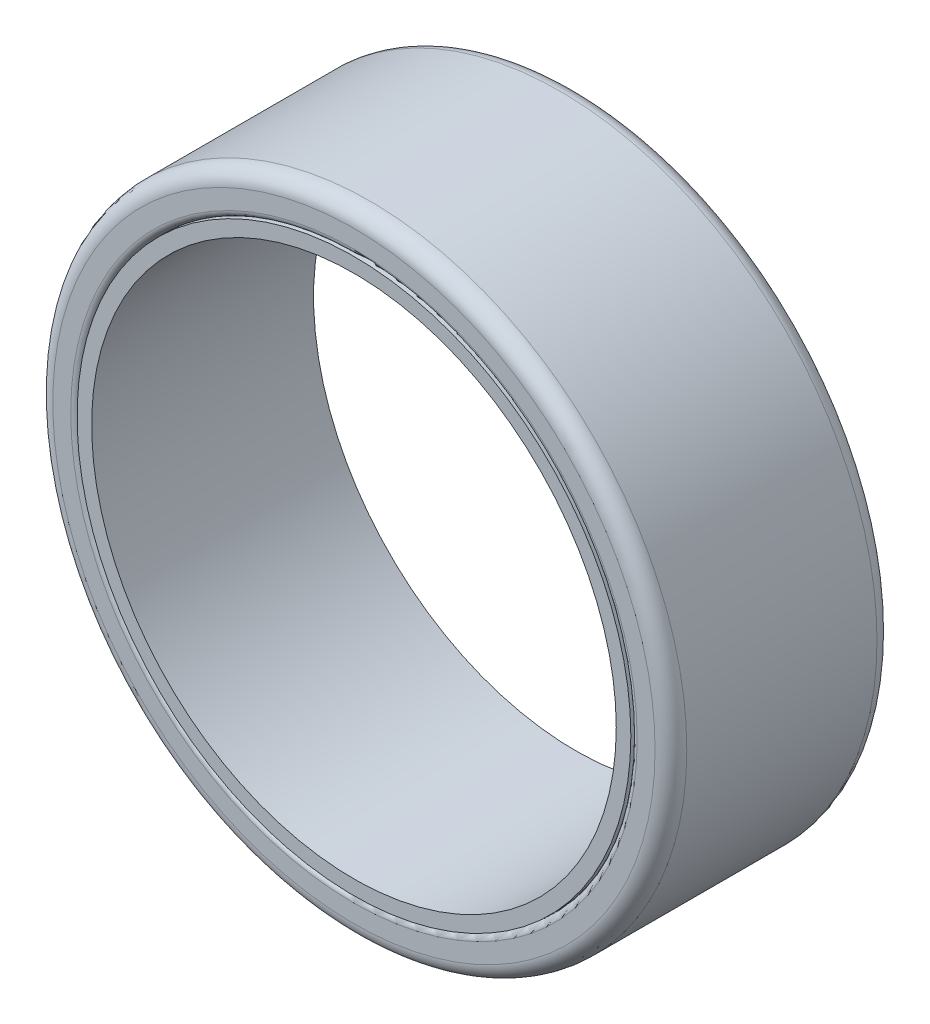
ISO-10303-21;
HEADER;
FILE_DESCRIPTION(('STEP AP214'),'2;1');
FILE_NAME('part.step','',(''),(''),'','','');
FILE_SCHEMA(('AUTOMOTIVE_DESIGN { 1 0 10303 214 1 1 1 1 }'));
ENDSEC;
DATA;
#1=APPLICATION_CONTEXT('core data for automotive mechanical design processes');
#2=APPLICATION_PROTOCOL_DEFINITION('international standard','automotive_design',2000,#1);
#3=PRODUCT_CONTEXT('',#1,'mechanical');
#4=PRODUCT('Part','Part','',(#3));
#5=PRODUCT_RELATED_PRODUCT_CATEGORY('part','',(#4));
#6=PRODUCT_DEFINITION_FORMATION('','',#4);
#7=PRODUCT_DEFINITION_CONTEXT('part definition',#1,'design');
#8=PRODUCT_DEFINITION('design','',#6,#7);
#9=PRODUCT_DEFINITION_SHAPE('','',#8);
#10=(LENGTH_UNIT() NAMED_UNIT(*) SI_UNIT(.MILLI.,.METRE.));
#11=(NAMED_UNIT(*) PLANE_ANGLE_UNIT() SI_UNIT($,.RADIAN.));
#12=(NAMED_UNIT(*) SI_UNIT($,.STERADIAN.) SOLID_ANGLE_UNIT());
#13=UNCERTAINTY_MEASURE_WITH_UNIT(LENGTH_MEASURE(1.E-05),#10,'distance_accuracy_value','');
#14=(GEOMETRIC_REPRESENTATION_CONTEXT(3) GLOBAL_UNCERTAINTY_ASSIGNED_CONTEXT((#13)) GLOBAL_UNIT_ASSIGNED_CONTEXT((#10,
#11,#12)) REPRESENTATION_CONTEXT('',''));
#15=CARTESIAN_POINT('',(0.,0.,0.));
#16=DIRECTION('',(0.,0.,1.));
#17=DIRECTION('',(1.,0.,0.));
#18=AXIS2_PLACEMENT_3D('',#15,#16,#17);
#19=CARTESIAN_POINT('',(0.,0.,-282.06752625417));
#20=DIRECTION('',(0.,0.,1.));
#21=DIRECTION('',(1.,0.,0.));
#22=AXIS2_PLACEMENT_3D('',#19,#20,#21);
#23=CYLINDRICAL_SURFACE('',#22,87.3515616126545);
#24=CARTESIAN_POINT('',(0.,0.,-35.));
#25=DIRECTION('',(0.,0.,1.));
#26=DIRECTION('',(1.,0.,0.));
#27=AXIS2_PLACEMENT_3D('',#24,#25,#26);
#28=CIRCLE('',#27,87.3515616126545);
#29=CARTESIAN_POINT('',(87.3515616126545,0.,-35.));
#30=VERTEX_POINT('',#29);
#31=EDGE_CURVE('E11',#30,#30,#28,.F.);
#32=ORIENTED_EDGE('',*,*,#31,.F.);
#33=EDGE_LOOP('',(#32));
#34=FACE_BOUND('',#33,.T.);
#35=CARTESIAN_POINT('',(0.,0.,35.));
#36=DIRECTION('',(0.,0.,1.));
#37=DIRECTION('',(1.,0.,0.));
#38=AXIS2_PLACEMENT_3D('',#35,#36,#37);
#39=CIRCLE('',#38,87.3515616126545);
#40=CARTESIAN_POINT('',(87.3515616126545,0.,35.));
#41=VERTEX_POINT('',#40);
#42=EDGE_CURVE('E52',#41,#41,#39,.T.);
#43=ORIENTED_EDGE('',*,*,#42,.F.);
#44=EDGE_LOOP('',(#43));
#45=FACE_BOUND('',#44,.T.);
#46=ADVANCED_FACE('F41',(#34,#45),#23,.T.);
#47=CARTESIAN_POINT('',(0.,0.,35.));
#48=DIRECTION('',(0.,0.,1.));
#49=DIRECTION('',(1.,0.,0.));
#50=AXIS2_PLACEMENT_3D('',#47,#48,#49);
#51=PLANE('',#50);
#52=CARTESIAN_POINT('',(0.,0.,35.));
#53=DIRECTION('',(0.,0.,1.));
#54=DIRECTION('',(1.,0.,0.));
#55=AXIS2_PLACEMENT_3D('',#52,#53,#54);
#56=CIRCLE('',#55,82.7517063993056);
#57=CARTESIAN_POINT('',(82.7517063993056,0.,35.));
#58=VERTEX_POINT('',#57);
#59=EDGE_CURVE('E54',#58,#58,#56,.T.);
#60=ORIENTED_EDGE('',*,*,#59,.F.);
#61=EDGE_LOOP('',(#60));
#62=FACE_BOUND('',#61,.T.);
#63=ORIENTED_EDGE('',*,*,#42,.T.);
#64=EDGE_LOOP('',(#63));
#65=FACE_BOUND('',#64,.T.);
#66=ADVANCED_FACE('F59',(#62,#65),#51,.T.);
#67=CARTESIAN_POINT('',(0.,0.,-282.06752625417));
#68=DIRECTION('',(0.,0.,1.));
#69=DIRECTION('',(1.,0.,0.));
#70=AXIS2_PLACEMENT_3D('',#67,#68,#69);
#71=CYLINDRICAL_SURFACE('',#70,82.7517063993056);
#72=CARTESIAN_POINT('',(0.,0.,-35.));
#73=DIRECTION('',(0.,0.,1.));
#74=DIRECTION('',(1.,0.,0.));
#75=AXIS2_PLACEMENT_3D('',#72,#73,#74);
#76=CIRCLE('',#75,82.7517063993056);
#77=CARTESIAN_POINT('',(82.7517063993056,0.,-35.));
#78=VERTEX_POINT('',#77);
#79=EDGE_CURVE('E44',#78,#78,#76,.F.);
#80=ORIENTED_EDGE('',*,*,#79,.T.);
#81=EDGE_LOOP('',(#80));
#82=FACE_BOUND('',#81,.T.);
#83=ORIENTED_EDGE('',*,*,#59,.T.);
#84=EDGE_LOOP('',(#83));
#85=FACE_BOUND('',#84,.T.);
#86=ADVANCED_FACE('F66',(#82,#85),#71,.F.);
#87=CARTESIAN_POINT('',(0.,0.,-35.));
#88=DIRECTION('',(0.,0.,1.));
#89=DIRECTION('',(1.,0.,0.));
#90=AXIS2_PLACEMENT_3D('',#87,#88,#89);
#91=PLANE('',#90);
#92=ORIENTED_EDGE('',*,*,#31,.T.);
#93=EDGE_LOOP('',(#92));
#94=FACE_BOUND('',#93,.T.);
#95=ORIENTED_EDGE('',*,*,#79,.F.);
#96=EDGE_LOOP('',(#95));
#97=FACE_BOUND('',#96,.T.);
#98=ADVANCED_FACE('F71',(#94,#97),#91,.F.);
#99=CLOSED_SHELL('',(#46,#66,#86,#98));
#100=MANIFOLD_SOLID_BREP('B2',#99);
#101=CARTESIAN_POINT('',(0.,0.,-35.));
#102=DIRECTION('',(0.,0.,1.));
#103=DIRECTION('',(1.,0.,0.));
#104=AXIS2_PLACEMENT_3D('',#101,#102,#103);
#105=CYLINDRICAL_SURFACE('',#104,100.);
#106=CARTESIAN_POINT('',(0.,0.,30.));
#107=DIRECTION('',(0.,0.,1.));
#108=DIRECTION('',(1.,0.,0.));
#109=AXIS2_PLACEMENT_3D('',#106,#107,#108);
#110=CIRCLE('',#109,100.);
#111=CARTESIAN_POINT('',(100.,0.,30.));
#112=VERTEX_POINT('',#111);
#113=EDGE_CURVE('E126',#112,#112,#110,.F.);
#114=ORIENTED_EDGE('',*,*,#113,.T.);
#115=EDGE_LOOP('',(#114));
#116=FACE_BOUND('',#115,.T.);
#117=CARTESIAN_POINT('',(0.,0.,-30.));
#118=DIRECTION('',(0.,0.,1.));
#119=DIRECTION('',(1.,0.,0.));
#120=AXIS2_PLACEMENT_3D('',#117,#118,#119);
#121=CIRCLE('',#120,100.);
#122=CARTESIAN_POINT('',(100.,0.,-30.));
#123=VERTEX_POINT('',#122);
#124=EDGE_CURVE('E129',#123,#123,#121,.T.);
#125=ORIENTED_EDGE('',*,*,#124,.T.);
#126=EDGE_LOOP('',(#125));
#127=FACE_BOUND('',#126,.T.);
#128=ADVANCED_FACE('F103',(#116,#127),#105,.T.);
#129=CARTESIAN_POINT('',(0.,0.,-35.));
#130=DIRECTION('',(0.,0.,1.));
#131=DIRECTION('',(1.,0.,0.));
#132=AXIS2_PLACEMENT_3D('',#129,#130,#131);
#133=PLANE('',#132);
#134=CARTESIAN_POINT('',(0.,0.,-35.));
#135=DIRECTION('',(0.,0.,1.));
#136=DIRECTION('',(1.,0.,0.));
#137=AXIS2_PLACEMENT_3D('',#134,#135,#136);
#138=CIRCLE('',#137,89.3515616126545);
#139=CARTESIAN_POINT('',(89.3515616126545,0.,-35.));
#140=VERTEX_POINT('',#139);
#141=EDGE_CURVE('E40',#140,#140,#138,.T.);
#142=ORIENTED_EDGE('',*,*,#141,.T.);
#143=EDGE_LOOP('',(#142));
#144=FACE_BOUND('',#143,.T.);
#145=CARTESIAN_POINT('',(0.,0.,-35.));
#146=DIRECTION('',(0.,0.,1.));
#147=DIRECTION('',(1.,0.,0.));
#148=AXIS2_PLACEMENT_3D('',#145,#146,#147);
#149=CIRCLE('',#148,95.);
#150=CARTESIAN_POINT('',(95.,0.,-35.));
#151=VERTEX_POINT('',#150);
#152=EDGE_CURVE('E123',#151,#151,#149,.F.);
#153=ORIENTED_EDGE('',*,*,#152,.T.);
#154=EDGE_LOOP('',(#153));
#155=FACE_BOUND('',#154,.T.);
#156=ADVANCED_FACE('F155',(#144,#155),#133,.F.);
#157=CARTESIAN_POINT('',(0.,0.,-35.));
#158=DIRECTION('',(0.,0.,1.));
#159=DIRECTION('',(1.,0.,0.));
#160=AXIS2_PLACEMENT_3D('',#157,#158,#159);
#161=CYLINDRICAL_SURFACE('',#160,87.3515616126545);
#162=CARTESIAN_POINT('',(0.,0.,33.));
#163=DIRECTION('',(0.,0.,1.));
#164=DIRECTION('',(1.,0.,0.));
#165=AXIS2_PLACEMENT_3D('',#162,#163,#164);
#166=CIRCLE('',#165,87.3515616126545);
#167=CARTESIAN_POINT('',(87.3515616126545,0.,33.));
#168=VERTEX_POINT('',#167);
#169=EDGE_CURVE('E114',#168,#168,#166,.T.);
#170=ORIENTED_EDGE('',*,*,#169,.T.);
#171=EDGE_LOOP('',(#170));
#172=FACE_BOUND('',#171,.T.);
#173=CARTESIAN_POINT('',(0.,0.,-33.));
#174=DIRECTION('',(0.,0.,1.));
#175=DIRECTION('',(1.,0.,0.));
#176=AXIS2_PLACEMENT_3D('',#173,#174,#175);
#177=CIRCLE('',#176,87.3515616126545);
#178=CARTESIAN_POINT('',(87.3515616126545,0.,-33.));
#179=VERTEX_POINT('',#178);
#180=EDGE_CURVE('E118',#179,#179,#177,.F.);
#181=ORIENTED_EDGE('',*,*,#180,.T.);
#182=EDGE_LOOP('',(#181));
#183=FACE_BOUND('',#182,.T.);
#184=ADVANCED_FACE('F150',(#172,#183),#161,.F.);
#185=CARTESIAN_POINT('',(0.,0.,35.));
#186=DIRECTION('',(0.,0.,1.));
#187=DIRECTION('',(1.,0.,0.));
#188=AXIS2_PLACEMENT_3D('',#185,#186,#187);
#189=PLANE('',#188);
#190=CARTESIAN_POINT('',(0.,0.,35.));
#191=DIRECTION('',(0.,0.,1.));
#192=DIRECTION('',(1.,0.,0.));
#193=AXIS2_PLACEMENT_3D('',#190,#191,#192);
#194=CIRCLE('',#193,89.3515616126545);
#195=CARTESIAN_POINT('',(89.3515616126545,0.,35.));
#196=VERTEX_POINT('',#195);
#197=EDGE_CURVE('E110',#196,#196,#194,.F.);
#198=ORIENTED_EDGE('',*,*,#197,.T.);
#199=EDGE_LOOP('',(#198));
#200=FACE_BOUND('',#199,.T.);
#201=CARTESIAN_POINT('',(0.,0.,35.));
#202=DIRECTION('',(0.,0.,1.));
#203=DIRECTION('',(1.,0.,0.));
#204=AXIS2_PLACEMENT_3D('',#201,#202,#203);
#205=CIRCLE('',#204,95.);
#206=CARTESIAN_POINT('',(95.,0.,35.));
#207=VERTEX_POINT('',#206);
#208=EDGE_CURVE('E132',#207,#207,#205,.T.);
#209=ORIENTED_EDGE('',*,*,#208,.T.);
#210=EDGE_LOOP('',(#209));
#211=FACE_BOUND('',#210,.T.);
#212=ADVANCED_FACE('F136',(#200,#211),#189,.T.);
#213=CARTESIAN_POINT('',(0.,0.,30.));
#214=DIRECTION('',(0.,0.,1.));
#215=DIRECTION('',(1.,0.,0.));
#216=AXIS2_PLACEMENT_3D('',#213,#214,#215);
#217=TOROIDAL_SURFACE('',#216,95.,5.);
#218=ORIENTED_EDGE('',*,*,#113,.F.);
#219=EDGE_LOOP('',(#218));
#220=FACE_BOUND('',#219,.T.);
#221=ORIENTED_EDGE('',*,*,#208,.F.);
#222=EDGE_LOOP('',(#221));
#223=FACE_BOUND('',#222,.T.);
#224=ADVANCED_FACE('F138',(#220,#223),#217,.T.);
#225=CARTESIAN_POINT('',(0.,0.,-30.));
#226=DIRECTION('',(0.,0.,1.));
#227=DIRECTION('',(1.,0.,0.));
#228=AXIS2_PLACEMENT_3D('',#225,#226,#227);
#229=TOROIDAL_SURFACE('',#228,95.,5.);
#230=ORIENTED_EDGE('',*,*,#152,.F.);
#231=EDGE_LOOP('',(#230));
#232=FACE_BOUND('',#231,.T.);
#233=ORIENTED_EDGE('',*,*,#124,.F.);
#234=EDGE_LOOP('',(#233));
#235=FACE_BOUND('',#234,.T.);
#236=ADVANCED_FACE('F140',(#232,#235),#229,.T.);
#237=CARTESIAN_POINT('',(0.,0.,33.));
#238=DIRECTION('',(0.,0.,1.));
#239=DIRECTION('',(1.,0.,0.));
#240=AXIS2_PLACEMENT_3D('',#237,#238,#239);
#241=TOROIDAL_SURFACE('',#240,89.3515616126545,2.);
#242=ORIENTED_EDGE('',*,*,#197,.F.);
#243=EDGE_LOOP('',(#242));
#244=FACE_BOUND('',#243,.T.);
#245=ORIENTED_EDGE('',*,*,#169,.F.);
#246=EDGE_LOOP('',(#245));
#247=FACE_BOUND('',#246,.T.);
#248=ADVANCED_FACE('F147',(#244,#247),#241,.T.);
#249=CARTESIAN_POINT('',(0.,0.,-33.));
#250=DIRECTION('',(0.,0.,1.));
#251=DIRECTION('',(1.,0.,0.));
#252=AXIS2_PLACEMENT_3D('',#249,#250,#251);
#253=TOROIDAL_SURFACE('',#252,89.3515616126545,2.);
#254=ORIENTED_EDGE('',*,*,#180,.F.);
#255=EDGE_LOOP('',(#254));
#256=FACE_BOUND('',#255,.T.);
#257=ORIENTED_EDGE('',*,*,#141,.F.);
#258=EDGE_LOOP('',(#257));
#259=FACE_BOUND('',#258,.T.);
#260=ADVANCED_FACE('F105',(#256,#259),#253,.T.);
#261=CLOSED_SHELL('',(#128,#156,#184,#212,#224,#236,#248,#260));
#262=MANIFOLD_SOLID_BREP('B6',#261);
#263=ADVANCED_BREP_SHAPE_REPRESENTATION('',(#18,#100,#262),#14);
#264=SHAPE_DEFINITION_REPRESENTATION(#9,#263);
ENDSEC;
END-ISO-10303-21;
